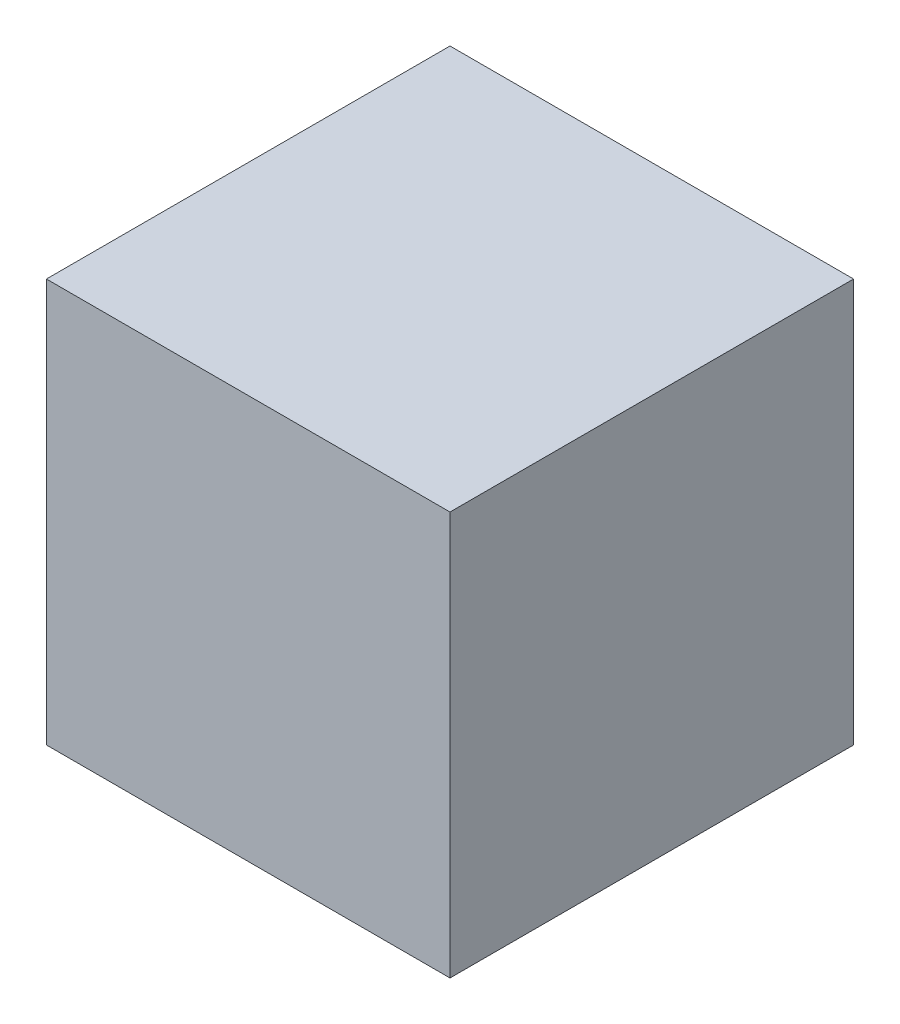
ISO-10303-21;
HEADER;
FILE_DESCRIPTION(('STEP AP214'),'2;1');
FILE_NAME('part.step','',(''),(''),'','','');
FILE_SCHEMA(('AUTOMOTIVE_DESIGN { 1 0 10303 214 1 1 1 1 }'));
ENDSEC;
DATA;
#1=APPLICATION_CONTEXT('core data for automotive mechanical design processes');
#2=APPLICATION_PROTOCOL_DEFINITION('international standard','automotive_design',2000,#1);
#3=PRODUCT_CONTEXT('',#1,'mechanical');
#4=PRODUCT('Part','Part','',(#3));
#5=PRODUCT_RELATED_PRODUCT_CATEGORY('part','',(#4));
#6=PRODUCT_DEFINITION_FORMATION('','',#4);
#7=PRODUCT_DEFINITION_CONTEXT('part definition',#1,'design');
#8=PRODUCT_DEFINITION('design','',#6,#7);
#9=PRODUCT_DEFINITION_SHAPE('','',#8);
#10=(LENGTH_UNIT() NAMED_UNIT(*) SI_UNIT(.MILLI.,.METRE.));
#11=(NAMED_UNIT(*) PLANE_ANGLE_UNIT() SI_UNIT($,.RADIAN.));
#12=(NAMED_UNIT(*) SI_UNIT($,.STERADIAN.) SOLID_ANGLE_UNIT());
#13=UNCERTAINTY_MEASURE_WITH_UNIT(LENGTH_MEASURE(1.E-05),#10,'distance_accuracy_value','');
#14=(GEOMETRIC_REPRESENTATION_CONTEXT(3) GLOBAL_UNCERTAINTY_ASSIGNED_CONTEXT((#13)) GLOBAL_UNIT_ASSIGNED_CONTEXT((#10,
#11,#12)) REPRESENTATION_CONTEXT('',''));
#15=CARTESIAN_POINT('',(0.,0.,0.));
#16=DIRECTION('',(0.,0.,1.));
#17=DIRECTION('',(1.,0.,0.));
#18=AXIS2_PLACEMENT_3D('',#15,#16,#17);
#19=CARTESIAN_POINT('',(3628.59960240025,-3628.59960240025,3628.5996024));
#20=DIRECTION('',(-1.,0.,0.));
#21=DIRECTION('',(0.,-1.,0.));
#22=AXIS2_PLACEMENT_3D('',#19,#20,#21);
#23=PLANE('',#22);
#24=DIRECTION('',(0.,1.,0.));
#25=VECTOR('',#24,1.);
#26=CARTESIAN_POINT('',(3628.59960240025,-3628.59960240025,-3628.5996024));
#27=LINE('',#26,#25);
#28=CARTESIAN_POINT('',(3628.59960240025,-3628.59960240025,-3628.5996024));
#29=VERTEX_POINT('',#28);
#30=CARTESIAN_POINT('',(3628.59960240025,3628.59960240025,-3628.5996024));
#31=VERTEX_POINT('',#30);
#32=EDGE_CURVE('E97',#29,#31,#27,.T.);
#33=ORIENTED_EDGE('',*,*,#32,.T.);
#34=DIRECTION('',(0.,0.,-1.));
#35=VECTOR('',#34,1.);
#36=CARTESIAN_POINT('',(3628.59960240025,3628.59960240025,3628.5996024));
#37=LINE('',#36,#35);
#38=CARTESIAN_POINT('',(3628.59960240025,3628.59960240025,3628.5996024));
#39=VERTEX_POINT('',#38);
#40=EDGE_CURVE('E11',#39,#31,#37,.T.);
#41=ORIENTED_EDGE('',*,*,#40,.F.);
#42=DIRECTION('',(0.,1.,0.));
#43=VECTOR('',#42,1.);
#44=CARTESIAN_POINT('',(3628.59960240025,-3628.59960240025,3628.5996024));
#45=LINE('',#44,#43);
#46=CARTESIAN_POINT('',(3628.59960240025,-3628.59960240025,3628.5996024));
#47=VERTEX_POINT('',#46);
#48=EDGE_CURVE('E85',#47,#39,#45,.T.);
#49=ORIENTED_EDGE('',*,*,#48,.F.);
#50=DIRECTION('',(0.,0.,-1.));
#51=VECTOR('',#50,1.);
#52=CARTESIAN_POINT('',(3628.59960240025,-3628.59960240025,3628.5996024));
#53=LINE('',#52,#51);
#54=EDGE_CURVE('E93',#47,#29,#53,.T.);
#55=ORIENTED_EDGE('',*,*,#54,.T.);
#56=EDGE_LOOP('',(#33,#41,#49,#55));
#57=FACE_BOUND('',#56,.T.);
#58=ADVANCED_FACE('F34',(#57),#23,.F.);
#59=CARTESIAN_POINT('',(3628.59960240025,3628.59960240025,3628.5996024));
#60=DIRECTION('',(0.,-1.,0.));
#61=DIRECTION('',(1.,0.,0.));
#62=AXIS2_PLACEMENT_3D('',#59,#60,#61);
#63=PLANE('',#62);
#64=DIRECTION('',(-1.,0.,0.));
#65=VECTOR('',#64,1.);
#66=CARTESIAN_POINT('',(3628.59960240025,3628.59960240025,-3628.5996024));
#67=LINE('',#66,#65);
#68=CARTESIAN_POINT('',(-3628.59960240025,3628.59960240025,-3628.5996024));
#69=VERTEX_POINT('',#68);
#70=EDGE_CURVE('E89',#31,#69,#67,.T.);
#71=ORIENTED_EDGE('',*,*,#70,.T.);
#72=DIRECTION('',(0.,0.,-1.));
#73=VECTOR('',#72,1.);
#74=CARTESIAN_POINT('',(-3628.59960240025,3628.59960240025,3628.5996024));
#75=LINE('',#74,#73);
#76=CARTESIAN_POINT('',(-3628.59960240025,3628.59960240025,3628.5996024));
#77=VERTEX_POINT('',#76);
#78=EDGE_CURVE('E42',#77,#69,#75,.T.);
#79=ORIENTED_EDGE('',*,*,#78,.F.);
#80=DIRECTION('',(-1.,0.,0.));
#81=VECTOR('',#80,1.);
#82=CARTESIAN_POINT('',(3628.59960240025,3628.59960240025,3628.5996024));
#83=LINE('',#82,#81);
#84=EDGE_CURVE('E80',#39,#77,#83,.T.);
#85=ORIENTED_EDGE('',*,*,#84,.F.);
#86=ORIENTED_EDGE('',*,*,#40,.T.);
#87=EDGE_LOOP('',(#71,#79,#85,#86));
#88=FACE_BOUND('',#87,.T.);
#89=ADVANCED_FACE('F88',(#88),#63,.F.);
#90=CARTESIAN_POINT('',(-3628.59960240025,3628.59960240025,3628.5996024));
#91=DIRECTION('',(1.,0.,0.));
#92=DIRECTION('',(0.,1.,0.));
#93=AXIS2_PLACEMENT_3D('',#90,#91,#92);
#94=PLANE('',#93);
#95=DIRECTION('',(0.,-1.,0.));
#96=VECTOR('',#95,1.);
#97=CARTESIAN_POINT('',(-3628.59960240025,3628.59960240025,-3628.5996024));
#98=LINE('',#97,#96);
#99=CARTESIAN_POINT('',(-3628.59960240025,-3628.59960240025,-3628.5996024));
#100=VERTEX_POINT('',#99);
#101=EDGE_CURVE('E67',#69,#100,#98,.T.);
#102=ORIENTED_EDGE('',*,*,#101,.T.);
#103=DIRECTION('',(0.,0.,-1.));
#104=VECTOR('',#103,1.);
#105=CARTESIAN_POINT('',(-3628.59960240025,-3628.59960240025,3628.5996024));
#106=LINE('',#105,#104);
#107=CARTESIAN_POINT('',(-3628.59960240025,-3628.59960240025,3628.5996024));
#108=VERTEX_POINT('',#107);
#109=EDGE_CURVE('E90',#108,#100,#106,.T.);
#110=ORIENTED_EDGE('',*,*,#109,.F.);
#111=DIRECTION('',(0.,-1.,0.));
#112=VECTOR('',#111,1.);
#113=CARTESIAN_POINT('',(-3628.59960240025,3628.59960240025,3628.5996024));
#114=LINE('',#113,#112);
#115=EDGE_CURVE('E83',#77,#108,#114,.T.);
#116=ORIENTED_EDGE('',*,*,#115,.F.);
#117=ORIENTED_EDGE('',*,*,#78,.T.);
#118=EDGE_LOOP('',(#102,#110,#116,#117));
#119=FACE_BOUND('',#118,.T.);
#120=ADVANCED_FACE('F91',(#119),#94,.F.);
#121=CARTESIAN_POINT('',(-3628.59960240025,-3628.59960240025,3628.5996024));
#122=DIRECTION('',(0.,1.,0.));
#123=DIRECTION('',(-1.,0.,0.));
#124=AXIS2_PLACEMENT_3D('',#121,#122,#123);
#125=PLANE('',#124);
#126=DIRECTION('',(1.,0.,0.));
#127=VECTOR('',#126,1.);
#128=CARTESIAN_POINT('',(-3628.59960240025,-3628.59960240025,-3628.5996024));
#129=LINE('',#128,#127);
#130=EDGE_CURVE('E73',#100,#29,#129,.T.);
#131=ORIENTED_EDGE('',*,*,#130,.T.);
#132=ORIENTED_EDGE('',*,*,#54,.F.);
#133=DIRECTION('',(1.,0.,0.));
#134=VECTOR('',#133,1.);
#135=CARTESIAN_POINT('',(-3628.59960240025,-3628.59960240025,3628.5996024));
#136=LINE('',#135,#134);
#137=EDGE_CURVE('E50',#108,#47,#136,.T.);
#138=ORIENTED_EDGE('',*,*,#137,.F.);
#139=ORIENTED_EDGE('',*,*,#109,.T.);
#140=EDGE_LOOP('',(#131,#132,#138,#139));
#141=FACE_BOUND('',#140,.T.);
#142=ADVANCED_FACE('F104',(#141),#125,.F.);
#143=CARTESIAN_POINT('',(0.,0.,3628.5996024));
#144=DIRECTION('',(0.,0.,1.));
#145=DIRECTION('',(1.,0.,0.));
#146=AXIS2_PLACEMENT_3D('',#143,#144,#145);
#147=PLANE('',#146);
#148=ORIENTED_EDGE('',*,*,#48,.T.);
#149=ORIENTED_EDGE('',*,*,#84,.T.);
#150=ORIENTED_EDGE('',*,*,#115,.T.);
#151=ORIENTED_EDGE('',*,*,#137,.T.);
#152=EDGE_LOOP('',(#148,#149,#150,#151));
#153=FACE_BOUND('',#152,.T.);
#154=ADVANCED_FACE('F81',(#153),#147,.T.);
#155=CARTESIAN_POINT('',(0.,0.,-3628.5996024));
#156=DIRECTION('',(0.,0.,1.));
#157=DIRECTION('',(1.,0.,0.));
#158=AXIS2_PLACEMENT_3D('',#155,#156,#157);
#159=PLANE('',#158);
#160=ORIENTED_EDGE('',*,*,#32,.F.);
#161=ORIENTED_EDGE('',*,*,#130,.F.);
#162=ORIENTED_EDGE('',*,*,#101,.F.);
#163=ORIENTED_EDGE('',*,*,#70,.F.);
#164=EDGE_LOOP('',(#160,#161,#162,#163));
#165=FACE_BOUND('',#164,.T.);
#166=ADVANCED_FACE('F107',(#165),#159,.F.);
#167=CLOSED_SHELL('',(#58,#89,#120,#142,#154,#166));
#168=MANIFOLD_SOLID_BREP('B2',#167);
#169=ADVANCED_BREP_SHAPE_REPRESENTATION('',(#18,#168),#14);
#170=SHAPE_DEFINITION_REPRESENTATION(#9,#169);
ENDSEC;
END-ISO-10303-21;
